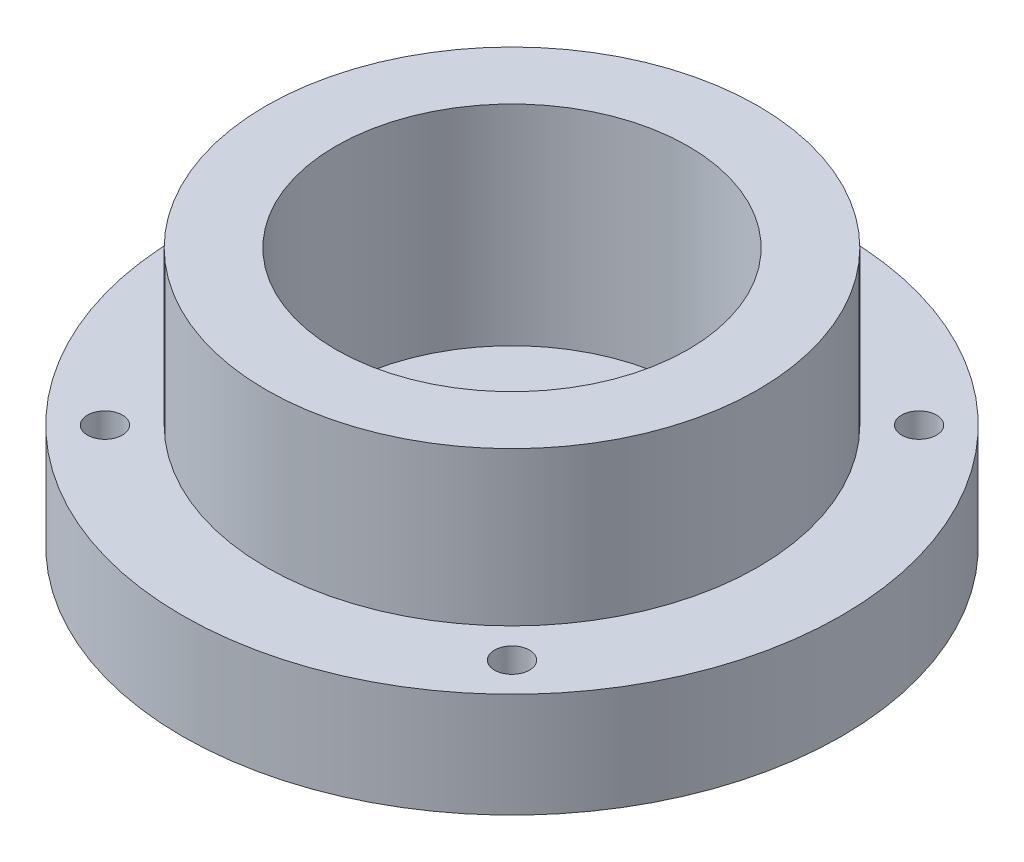
ISO-10303-21;
HEADER;
FILE_DESCRIPTION(('STEP AP214'),'2;1');
FILE_NAME('part.step','',(''),(''),'','','');
FILE_SCHEMA(('AUTOMOTIVE_DESIGN { 1 0 10303 214 1 1 1 1 }'));
ENDSEC;
DATA;
#1=APPLICATION_CONTEXT('core data for automotive mechanical design processes');
#2=APPLICATION_PROTOCOL_DEFINITION('international standard','automotive_design',2000,#1);
#3=PRODUCT_CONTEXT('',#1,'mechanical');
#4=PRODUCT('Part','Part','',(#3));
#5=PRODUCT_RELATED_PRODUCT_CATEGORY('part','',(#4));
#6=PRODUCT_DEFINITION_FORMATION('','',#4);
#7=PRODUCT_DEFINITION_CONTEXT('part definition',#1,'design');
#8=PRODUCT_DEFINITION('design','',#6,#7);
#9=PRODUCT_DEFINITION_SHAPE('','',#8);
#10=(LENGTH_UNIT() NAMED_UNIT(*) SI_UNIT(.MILLI.,.METRE.));
#11=(NAMED_UNIT(*) PLANE_ANGLE_UNIT() SI_UNIT($,.RADIAN.));
#12=(NAMED_UNIT(*) SI_UNIT($,.STERADIAN.) SOLID_ANGLE_UNIT());
#13=UNCERTAINTY_MEASURE_WITH_UNIT(LENGTH_MEASURE(1.E-05),#10,'distance_accuracy_value','');
#14=(GEOMETRIC_REPRESENTATION_CONTEXT(3) GLOBAL_UNCERTAINTY_ASSIGNED_CONTEXT((#13)) GLOBAL_UNIT_ASSIGNED_CONTEXT((#10,
#11,#12)) REPRESENTATION_CONTEXT('',''));
#15=CARTESIAN_POINT('',(0.,0.,0.));
#16=DIRECTION('',(0.,0.,1.));
#17=DIRECTION('',(1.,0.,0.));
#18=AXIS2_PLACEMENT_3D('',#15,#16,#17);
#19=CARTESIAN_POINT('',(0.,7.,0.));
#20=DIRECTION('',(0.,-1.,0.));
#21=DIRECTION('',(0.,0.,-1.));
#22=AXIS2_PLACEMENT_3D('',#19,#20,#21);
#23=CYLINDRICAL_SURFACE('',#22,35.25);
#24=CARTESIAN_POINT('',(0.,37.,0.));
#25=DIRECTION('',(0.,1.,0.));
#26=DIRECTION('',(0.,0.,1.));
#27=AXIS2_PLACEMENT_3D('',#24,#25,#26);
#28=CIRCLE('',#27,35.25);
#29=CARTESIAN_POINT('',(0.,37.,35.25));
#30=VERTEX_POINT('',#29);
#31=EDGE_CURVE('E50',#30,#30,#28,.T.);
#32=ORIENTED_EDGE('',*,*,#31,.F.);
#33=EDGE_LOOP('',(#32));
#34=FACE_BOUND('',#33,.T.);
#35=CARTESIAN_POINT('',(0.,15.,0.));
#36=DIRECTION('',(0.,-1.,0.));
#37=DIRECTION('',(0.,0.,-1.));
#38=AXIS2_PLACEMENT_3D('',#35,#36,#37);
#39=CIRCLE('',#38,35.25);
#40=CARTESIAN_POINT('',(0.,15.,-35.25));
#41=VERTEX_POINT('',#40);
#42=EDGE_CURVE('E10',#41,#41,#39,.T.);
#43=ORIENTED_EDGE('',*,*,#42,.F.);
#44=EDGE_LOOP('',(#43));
#45=FACE_BOUND('',#44,.T.);
#46=ADVANCED_FACE('F32',(#34,#45),#23,.T.);
#47=CARTESIAN_POINT('',(0.,7.,0.));
#48=DIRECTION('',(0.,1.,0.));
#49=DIRECTION('',(0.,0.,1.));
#50=AXIS2_PLACEMENT_3D('',#47,#48,#49);
#51=PLANE('',#50);
#52=CARTESIAN_POINT('',(20.0000000000006,7.,-5.65984895009786E-13));
#53=DIRECTION('',(0.,1.,0.));
#54=DIRECTION('',(0.,0.,1.));
#55=AXIS2_PLACEMENT_3D('',#52,#53,#54);
#56=CIRCLE('',#55,2.50000000000044);
#57=CARTESIAN_POINT('',(20.0000000000006,7.,2.49999999999988));
#58=VERTEX_POINT('',#57);
#59=EDGE_CURVE('E77',#58,#58,#56,.T.);
#60=ORIENTED_EDGE('',*,*,#59,.F.);
#61=EDGE_LOOP('',(#60));
#62=FACE_BOUND('',#61,.T.);
#63=CARTESIAN_POINT('',(1.13196979001957E-12,7.,20.));
#64=DIRECTION('',(0.,1.,0.));
#65=DIRECTION('',(0.,0.,1.));
#66=AXIS2_PLACEMENT_3D('',#63,#64,#65);
#67=CIRCLE('',#66,2.50000000000122);
#68=CARTESIAN_POINT('',(1.13196979001957E-12,7.,22.5000000000012));
#69=VERTEX_POINT('',#68);
#70=EDGE_CURVE('E71',#69,#69,#67,.T.);
#71=ORIENTED_EDGE('',*,*,#70,.F.);
#72=EDGE_LOOP('',(#71));
#73=FACE_BOUND('',#72,.T.);
#74=CARTESIAN_POINT('',(-19.9999999999994,7.,5.6843418860808E-13));
#75=DIRECTION('',(0.,1.,0.));
#76=DIRECTION('',(0.,0.,1.));
#77=AXIS2_PLACEMENT_3D('',#74,#75,#76);
#78=CIRCLE('',#77,2.50000000000091);
#79=CARTESIAN_POINT('',(-19.9999999999994,7.,2.50000000000148));
#80=VERTEX_POINT('',#79);
#81=EDGE_CURVE('E64',#80,#80,#78,.T.);
#82=ORIENTED_EDGE('',*,*,#81,.F.);
#83=EDGE_LOOP('',(#82));
#84=FACE_BOUND('',#83,.T.);
#85=CARTESIAN_POINT('',(0.,7.,-20.));
#86=DIRECTION('',(0.,1.,0.));
#87=DIRECTION('',(0.,0.,1.));
#88=AXIS2_PLACEMENT_3D('',#85,#86,#87);
#89=CIRCLE('',#88,2.5);
#90=CARTESIAN_POINT('',(0.,7.,-17.5));
#91=VERTEX_POINT('',#90);
#92=EDGE_CURVE('E58',#91,#91,#89,.T.);
#93=ORIENTED_EDGE('',*,*,#92,.F.);
#94=EDGE_LOOP('',(#93));
#95=FACE_BOUND('',#94,.T.);
#96=CARTESIAN_POINT('',(0.,7.,0.));
#97=DIRECTION('',(0.,1.,0.));
#98=DIRECTION('',(0.,0.,1.));
#99=AXIS2_PLACEMENT_3D('',#96,#97,#98);
#100=CIRCLE('',#99,15.5);
#101=CARTESIAN_POINT('',(0.,7.,15.5));
#102=VERTEX_POINT('',#101);
#103=EDGE_CURVE('E42',#102,#102,#100,.T.);
#104=ORIENTED_EDGE('',*,*,#103,.F.);
#105=EDGE_LOOP('',(#104));
#106=FACE_BOUND('',#105,.T.);
#107=CARTESIAN_POINT('',(0.,7.,0.));
#108=DIRECTION('',(0.,1.,0.));
#109=DIRECTION('',(0.,0.,1.));
#110=AXIS2_PLACEMENT_3D('',#107,#108,#109);
#111=CIRCLE('',#110,25.25);
#112=CARTESIAN_POINT('',(0.,7.,25.25));
#113=VERTEX_POINT('',#112);
#114=EDGE_CURVE('E38',#113,#113,#111,.F.);
#115=ORIENTED_EDGE('',*,*,#114,.F.);
#116=EDGE_LOOP('',(#115));
#117=FACE_BOUND('',#116,.T.);
#118=ADVANCED_FACE('F126',(#62,#73,#84,#95,#106,#117),#51,.T.);
#119=CARTESIAN_POINT('',(0.,0.,0.));
#120=DIRECTION('',(0.,1.,0.));
#121=DIRECTION('',(0.,0.,1.));
#122=AXIS2_PLACEMENT_3D('',#119,#120,#121);
#123=PLANE('',#122);
#124=CARTESIAN_POINT('',(29.1681547239467,0.,-29.1681547239451));
#125=DIRECTION('',(0.,-1.,0.));
#126=DIRECTION('',(0.,0.,-1.));
#127=AXIS2_PLACEMENT_3D('',#124,#125,#126);
#128=CIRCLE('',#127,2.49999999999958);
#129=CARTESIAN_POINT('',(29.1681547239467,0.,-31.6681547239447));
#130=VERTEX_POINT('',#129);
#131=EDGE_CURVE('E106',#130,#130,#128,.T.);
#132=ORIENTED_EDGE('',*,*,#131,.F.);
#133=EDGE_LOOP('',(#132));
#134=FACE_BOUND('',#133,.T.);
#135=CARTESIAN_POINT('',(-29.1681547239435,0.,-29.1681547239467));
#136=DIRECTION('',(0.,-1.,0.));
#137=DIRECTION('',(0.,0.,-1.));
#138=AXIS2_PLACEMENT_3D('',#135,#136,#137);
#139=CIRCLE('',#138,2.50000000000122);
#140=CARTESIAN_POINT('',(-29.1681547239435,0.,-31.6681547239479));
#141=VERTEX_POINT('',#140);
#142=EDGE_CURVE('E100',#141,#141,#139,.T.);
#143=ORIENTED_EDGE('',*,*,#142,.F.);
#144=EDGE_LOOP('',(#143));
#145=FACE_BOUND('',#144,.T.);
#146=CARTESIAN_POINT('',(-29.168154723945,0.,29.1681547239435));
#147=DIRECTION('',(0.,-1.,0.));
#148=DIRECTION('',(0.,0.,-1.));
#149=AXIS2_PLACEMENT_3D('',#146,#147,#148);
#150=CIRCLE('',#149,2.50000000000177);
#151=CARTESIAN_POINT('',(-29.168154723945,0.,26.6681547239417));
#152=VERTEX_POINT('',#151);
#153=EDGE_CURVE('E94',#152,#152,#150,.T.);
#154=ORIENTED_EDGE('',*,*,#153,.F.);
#155=EDGE_LOOP('',(#154));
#156=FACE_BOUND('',#155,.T.);
#157=CARTESIAN_POINT('',(29.1681547239451,0.,29.168154723945));
#158=DIRECTION('',(0.,-1.,0.));
#159=DIRECTION('',(0.,0.,-1.));
#160=AXIS2_PLACEMENT_3D('',#157,#158,#159);
#161=CIRCLE('',#160,2.5);
#162=CARTESIAN_POINT('',(29.1681547239451,0.,26.668154723945));
#163=VERTEX_POINT('',#162);
#164=EDGE_CURVE('E88',#163,#163,#161,.T.);
#165=ORIENTED_EDGE('',*,*,#164,.F.);
#166=EDGE_LOOP('',(#165));
#167=FACE_BOUND('',#166,.T.);
#168=CARTESIAN_POINT('',(20.0000000000006,0.,-5.65984895009786E-13));
#169=DIRECTION('',(0.,1.,0.));
#170=DIRECTION('',(0.,0.,1.));
#171=AXIS2_PLACEMENT_3D('',#168,#169,#170);
#172=CIRCLE('',#171,2.50000000000044);
#173=CARTESIAN_POINT('',(20.0000000000006,0.,2.49999999999988));
#174=VERTEX_POINT('',#173);
#175=EDGE_CURVE('E61',#174,#174,#172,.T.);
#176=ORIENTED_EDGE('',*,*,#175,.T.);
#177=EDGE_LOOP('',(#176));
#178=FACE_BOUND('',#177,.T.);
#179=CARTESIAN_POINT('',(1.13196979001957E-12,0.,20.));
#180=DIRECTION('',(0.,1.,0.));
#181=DIRECTION('',(0.,0.,1.));
#182=AXIS2_PLACEMENT_3D('',#179,#180,#181);
#183=CIRCLE('',#182,2.50000000000122);
#184=CARTESIAN_POINT('',(1.13196979001957E-12,0.,22.5000000000012));
#185=VERTEX_POINT('',#184);
#186=EDGE_CURVE('E74',#185,#185,#183,.T.);
#187=ORIENTED_EDGE('',*,*,#186,.T.);
#188=EDGE_LOOP('',(#187));
#189=FACE_BOUND('',#188,.T.);
#190=CARTESIAN_POINT('',(-19.9999999999994,0.,5.6843418860808E-13));
#191=DIRECTION('',(0.,1.,0.));
#192=DIRECTION('',(0.,0.,1.));
#193=AXIS2_PLACEMENT_3D('',#190,#191,#192);
#194=CIRCLE('',#193,2.50000000000091);
#195=CARTESIAN_POINT('',(-19.9999999999994,0.,2.50000000000148));
#196=VERTEX_POINT('',#195);
#197=EDGE_CURVE('E67',#196,#196,#194,.T.);
#198=ORIENTED_EDGE('',*,*,#197,.T.);
#199=EDGE_LOOP('',(#198));
#200=FACE_BOUND('',#199,.T.);
#201=CARTESIAN_POINT('',(0.,0.,-20.));
#202=DIRECTION('',(0.,1.,0.));
#203=DIRECTION('',(0.,0.,1.));
#204=AXIS2_PLACEMENT_3D('',#201,#202,#203);
#205=CIRCLE('',#204,2.5);
#206=CARTESIAN_POINT('',(0.,0.,-17.5));
#207=VERTEX_POINT('',#206);
#208=EDGE_CURVE('E57',#207,#207,#205,.T.);
#209=ORIENTED_EDGE('',*,*,#208,.T.);
#210=EDGE_LOOP('',(#209));
#211=FACE_BOUND('',#210,.T.);
#212=CARTESIAN_POINT('',(0.,0.,0.));
#213=DIRECTION('',(0.,1.,0.));
#214=DIRECTION('',(0.,0.,1.));
#215=AXIS2_PLACEMENT_3D('',#212,#213,#214);
#216=CIRCLE('',#215,15.5);
#217=CARTESIAN_POINT('',(0.,0.,15.5));
#218=VERTEX_POINT('',#217);
#219=EDGE_CURVE('E46',#218,#218,#216,.T.);
#220=ORIENTED_EDGE('',*,*,#219,.T.);
#221=EDGE_LOOP('',(#220));
#222=FACE_BOUND('',#221,.T.);
#223=CARTESIAN_POINT('',(0.,0.,0.));
#224=DIRECTION('',(0.,-1.,0.));
#225=DIRECTION('',(0.,0.,-1.));
#226=AXIS2_PLACEMENT_3D('',#223,#224,#225);
#227=CIRCLE('',#226,47.25);
#228=CARTESIAN_POINT('',(0.,0.,-47.25));
#229=VERTEX_POINT('',#228);
#230=EDGE_CURVE('E82',#229,#229,#227,.T.);
#231=ORIENTED_EDGE('',*,*,#230,.T.);
#232=EDGE_LOOP('',(#231));
#233=FACE_BOUND('',#232,.T.);
#234=ADVANCED_FACE('F122',(#134,#145,#156,#167,#178,#189,#200,#211,#222,#233),#123,.F.);
#235=CARTESIAN_POINT('',(0.,7.,0.));
#236=DIRECTION('',(0.,-1.,0.));
#237=DIRECTION('',(0.,0.,-1.));
#238=AXIS2_PLACEMENT_3D('',#235,#236,#237);
#239=CYLINDRICAL_SURFACE('',#238,15.5);
#240=ORIENTED_EDGE('',*,*,#103,.T.);
#241=EDGE_LOOP('',(#240));
#242=FACE_BOUND('',#241,.T.);
#243=ORIENTED_EDGE('',*,*,#219,.F.);
#244=EDGE_LOOP('',(#243));
#245=FACE_BOUND('',#244,.T.);
#246=ADVANCED_FACE('F125',(#242,#245),#239,.F.);
#247=CARTESIAN_POINT('',(0.,37.,0.));
#248=DIRECTION('',(0.,1.,0.));
#249=DIRECTION('',(0.,0.,1.));
#250=AXIS2_PLACEMENT_3D('',#247,#248,#249);
#251=PLANE('',#250);
#252=ORIENTED_EDGE('',*,*,#31,.T.);
#253=EDGE_LOOP('',(#252));
#254=FACE_BOUND('',#253,.T.);
#255=CARTESIAN_POINT('',(0.,37.,0.));
#256=DIRECTION('',(0.,1.,0.));
#257=DIRECTION('',(0.,0.,1.));
#258=AXIS2_PLACEMENT_3D('',#255,#256,#257);
#259=CIRCLE('',#258,25.25);
#260=CARTESIAN_POINT('',(0.,37.,25.25));
#261=VERTEX_POINT('',#260);
#262=EDGE_CURVE('E54',#261,#261,#259,.T.);
#263=ORIENTED_EDGE('',*,*,#262,.F.);
#264=EDGE_LOOP('',(#263));
#265=FACE_BOUND('',#264,.T.);
#266=ADVANCED_FACE('F169',(#254,#265),#251,.T.);
#267=CARTESIAN_POINT('',(0.,37.,0.));
#268=DIRECTION('',(0.,-1.,0.));
#269=DIRECTION('',(0.,0.,-1.));
#270=AXIS2_PLACEMENT_3D('',#267,#268,#269);
#271=CYLINDRICAL_SURFACE('',#270,25.25);
#272=ORIENTED_EDGE('',*,*,#262,.T.);
#273=EDGE_LOOP('',(#272));
#274=FACE_BOUND('',#273,.T.);
#275=ORIENTED_EDGE('',*,*,#114,.T.);
#276=EDGE_LOOP('',(#275));
#277=FACE_BOUND('',#276,.T.);
#278=ADVANCED_FACE('F172',(#274,#277),#271,.F.);
#279=CARTESIAN_POINT('',(0.,0.,-20.));
#280=DIRECTION('',(0.,1.,0.));
#281=DIRECTION('',(0.,0.,1.));
#282=AXIS2_PLACEMENT_3D('',#279,#280,#281);
#283=CYLINDRICAL_SURFACE('',#282,2.5);
#284=ORIENTED_EDGE('',*,*,#208,.F.);
#285=EDGE_LOOP('',(#284));
#286=FACE_BOUND('',#285,.T.);
#287=ORIENTED_EDGE('',*,*,#92,.T.);
#288=EDGE_LOOP('',(#287));
#289=FACE_BOUND('',#288,.T.);
#290=ADVANCED_FACE('F177',(#286,#289),#283,.F.);
#291=CARTESIAN_POINT('',(-19.9999999999994,0.,5.6843418860808E-13));
#292=DIRECTION('',(0.,1.,0.));
#293=DIRECTION('',(0.,0.,1.));
#294=AXIS2_PLACEMENT_3D('',#291,#292,#293);
#295=CYLINDRICAL_SURFACE('',#294,2.50000000000091);
#296=ORIENTED_EDGE('',*,*,#197,.F.);
#297=EDGE_LOOP('',(#296));
#298=FACE_BOUND('',#297,.T.);
#299=ORIENTED_EDGE('',*,*,#81,.T.);
#300=EDGE_LOOP('',(#299));
#301=FACE_BOUND('',#300,.T.);
#302=ADVANCED_FACE('F182',(#298,#301),#295,.F.);
#303=CARTESIAN_POINT('',(1.13196979001957E-12,0.,20.));
#304=DIRECTION('',(0.,1.,0.));
#305=DIRECTION('',(0.,0.,1.));
#306=AXIS2_PLACEMENT_3D('',#303,#304,#305);
#307=CYLINDRICAL_SURFACE('',#306,2.50000000000122);
#308=ORIENTED_EDGE('',*,*,#186,.F.);
#309=EDGE_LOOP('',(#308));
#310=FACE_BOUND('',#309,.T.);
#311=ORIENTED_EDGE('',*,*,#70,.T.);
#312=EDGE_LOOP('',(#311));
#313=FACE_BOUND('',#312,.T.);
#314=ADVANCED_FACE('F156',(#310,#313),#307,.F.);
#315=CARTESIAN_POINT('',(20.0000000000006,0.,-5.65984895009786E-13));
#316=DIRECTION('',(0.,1.,0.));
#317=DIRECTION('',(0.,0.,1.));
#318=AXIS2_PLACEMENT_3D('',#315,#316,#317);
#319=CYLINDRICAL_SURFACE('',#318,2.50000000000044);
#320=ORIENTED_EDGE('',*,*,#175,.F.);
#321=EDGE_LOOP('',(#320));
#322=FACE_BOUND('',#321,.T.);
#323=ORIENTED_EDGE('',*,*,#59,.T.);
#324=EDGE_LOOP('',(#323));
#325=FACE_BOUND('',#324,.T.);
#326=ADVANCED_FACE('F147',(#322,#325),#319,.F.);
#327=CARTESIAN_POINT('',(0.,15.,0.));
#328=DIRECTION('',(0.,-1.,0.));
#329=DIRECTION('',(0.,0.,-1.));
#330=AXIS2_PLACEMENT_3D('',#327,#328,#329);
#331=CYLINDRICAL_SURFACE('',#330,47.25);
#332=CARTESIAN_POINT('',(0.,15.,0.));
#333=DIRECTION('',(0.,-1.,0.));
#334=DIRECTION('',(0.,0.,-1.));
#335=AXIS2_PLACEMENT_3D('',#332,#333,#334);
#336=CIRCLE('',#335,47.25);
#337=CARTESIAN_POINT('',(0.,15.,-47.25));
#338=VERTEX_POINT('',#337);
#339=EDGE_CURVE('E68',#338,#338,#336,.T.);
#340=ORIENTED_EDGE('',*,*,#339,.T.);
#341=EDGE_LOOP('',(#340));
#342=FACE_BOUND('',#341,.T.);
#343=ORIENTED_EDGE('',*,*,#230,.F.);
#344=EDGE_LOOP('',(#343));
#345=FACE_BOUND('',#344,.T.);
#346=ADVANCED_FACE('F145',(#342,#345),#331,.T.);
#347=CARTESIAN_POINT('',(0.,15.,0.));
#348=DIRECTION('',(0.,-1.,0.));
#349=DIRECTION('',(0.,0.,-1.));
#350=AXIS2_PLACEMENT_3D('',#347,#348,#349);
#351=PLANE('',#350);
#352=CARTESIAN_POINT('',(29.1681547239467,15.,-29.1681547239451));
#353=DIRECTION('',(0.,-1.,0.));
#354=DIRECTION('',(0.,0.,-1.));
#355=AXIS2_PLACEMENT_3D('',#352,#353,#354);
#356=CIRCLE('',#355,2.49999999999958);
#357=CARTESIAN_POINT('',(29.1681547239467,15.,-31.6681547239447));
#358=VERTEX_POINT('',#357);
#359=EDGE_CURVE('E91',#358,#358,#356,.T.);
#360=ORIENTED_EDGE('',*,*,#359,.T.);
#361=EDGE_LOOP('',(#360));
#362=FACE_BOUND('',#361,.T.);
#363=CARTESIAN_POINT('',(-29.1681547239435,15.,-29.1681547239467));
#364=DIRECTION('',(0.,-1.,0.));
#365=DIRECTION('',(0.,0.,-1.));
#366=AXIS2_PLACEMENT_3D('',#363,#364,#365);
#367=CIRCLE('',#366,2.50000000000122);
#368=CARTESIAN_POINT('',(-29.1681547239435,15.,-31.6681547239479));
#369=VERTEX_POINT('',#368);
#370=EDGE_CURVE('E103',#369,#369,#367,.T.);
#371=ORIENTED_EDGE('',*,*,#370,.T.);
#372=EDGE_LOOP('',(#371));
#373=FACE_BOUND('',#372,.T.);
#374=CARTESIAN_POINT('',(-29.168154723945,15.,29.1681547239435));
#375=DIRECTION('',(0.,-1.,0.));
#376=DIRECTION('',(0.,0.,-1.));
#377=AXIS2_PLACEMENT_3D('',#374,#375,#376);
#378=CIRCLE('',#377,2.50000000000177);
#379=CARTESIAN_POINT('',(-29.168154723945,15.,26.6681547239417));
#380=VERTEX_POINT('',#379);
#381=EDGE_CURVE('E97',#380,#380,#378,.T.);
#382=ORIENTED_EDGE('',*,*,#381,.T.);
#383=EDGE_LOOP('',(#382));
#384=FACE_BOUND('',#383,.T.);
#385=CARTESIAN_POINT('',(29.1681547239451,15.,29.168154723945));
#386=DIRECTION('',(0.,-1.,0.));
#387=DIRECTION('',(0.,0.,-1.));
#388=AXIS2_PLACEMENT_3D('',#385,#386,#387);
#389=CIRCLE('',#388,2.5);
#390=CARTESIAN_POINT('',(29.1681547239451,15.,26.668154723945));
#391=VERTEX_POINT('',#390);
#392=EDGE_CURVE('E85',#391,#391,#389,.T.);
#393=ORIENTED_EDGE('',*,*,#392,.T.);
#394=EDGE_LOOP('',(#393));
#395=FACE_BOUND('',#394,.T.);
#396=ORIENTED_EDGE('',*,*,#42,.T.);
#397=EDGE_LOOP('',(#396));
#398=FACE_BOUND('',#397,.T.);
#399=ORIENTED_EDGE('',*,*,#339,.F.);
#400=EDGE_LOOP('',(#399));
#401=FACE_BOUND('',#400,.T.);
#402=ADVANCED_FACE('F112',(#362,#373,#384,#395,#398,#401),#351,.F.);
#403=CARTESIAN_POINT('',(29.1681547239451,15.,29.168154723945));
#404=DIRECTION('',(0.,-1.,0.));
#405=DIRECTION('',(0.,0.,-1.));
#406=AXIS2_PLACEMENT_3D('',#403,#404,#405);
#407=CYLINDRICAL_SURFACE('',#406,2.5);
#408=ORIENTED_EDGE('',*,*,#392,.F.);
#409=EDGE_LOOP('',(#408));
#410=FACE_BOUND('',#409,.T.);
#411=ORIENTED_EDGE('',*,*,#164,.T.);
#412=EDGE_LOOP('',(#411));
#413=FACE_BOUND('',#412,.T.);
#414=ADVANCED_FACE('F154',(#410,#413),#407,.F.);
#415=CARTESIAN_POINT('',(-29.168154723945,15.,29.1681547239435));
#416=DIRECTION('',(0.,-1.,0.));
#417=DIRECTION('',(0.,0.,-1.));
#418=AXIS2_PLACEMENT_3D('',#415,#416,#417);
#419=CYLINDRICAL_SURFACE('',#418,2.50000000000177);
#420=ORIENTED_EDGE('',*,*,#381,.F.);
#421=EDGE_LOOP('',(#420));
#422=FACE_BOUND('',#421,.T.);
#423=ORIENTED_EDGE('',*,*,#153,.T.);
#424=EDGE_LOOP('',(#423));
#425=FACE_BOUND('',#424,.T.);
#426=ADVANCED_FACE('F269',(#422,#425),#419,.F.);
#427=CARTESIAN_POINT('',(-29.1681547239435,15.,-29.1681547239467));
#428=DIRECTION('',(0.,-1.,0.));
#429=DIRECTION('',(0.,0.,-1.));
#430=AXIS2_PLACEMENT_3D('',#427,#428,#429);
#431=CYLINDRICAL_SURFACE('',#430,2.50000000000122);
#432=ORIENTED_EDGE('',*,*,#370,.F.);
#433=EDGE_LOOP('',(#432));
#434=FACE_BOUND('',#433,.T.);
#435=ORIENTED_EDGE('',*,*,#142,.T.);
#436=EDGE_LOOP('',(#435));
#437=FACE_BOUND('',#436,.T.);
#438=ADVANCED_FACE('F118',(#434,#437),#431,.F.);
#439=CARTESIAN_POINT('',(29.1681547239467,15.,-29.1681547239451));
#440=DIRECTION('',(0.,-1.,0.));
#441=DIRECTION('',(0.,0.,-1.));
#442=AXIS2_PLACEMENT_3D('',#439,#440,#441);
#443=CYLINDRICAL_SURFACE('',#442,2.49999999999958);
#444=ORIENTED_EDGE('',*,*,#359,.F.);
#445=EDGE_LOOP('',(#444));
#446=FACE_BOUND('',#445,.T.);
#447=ORIENTED_EDGE('',*,*,#131,.T.);
#448=EDGE_LOOP('',(#447));
#449=FACE_BOUND('',#448,.T.);
#450=ADVANCED_FACE('F115',(#446,#449),#443,.F.);
#451=CLOSED_SHELL('',(#46,#118,#234,#246,#266,#278,#290,#302,#314,#326,#346,#402,#414,#426,#438,#450));
#452=MANIFOLD_SOLID_BREP('B2',#451);
#453=ADVANCED_BREP_SHAPE_REPRESENTATION('',(#18,#452),#14);
#454=SHAPE_DEFINITION_REPRESENTATION(#9,#453);
ENDSEC;
END-ISO-10303-21;
